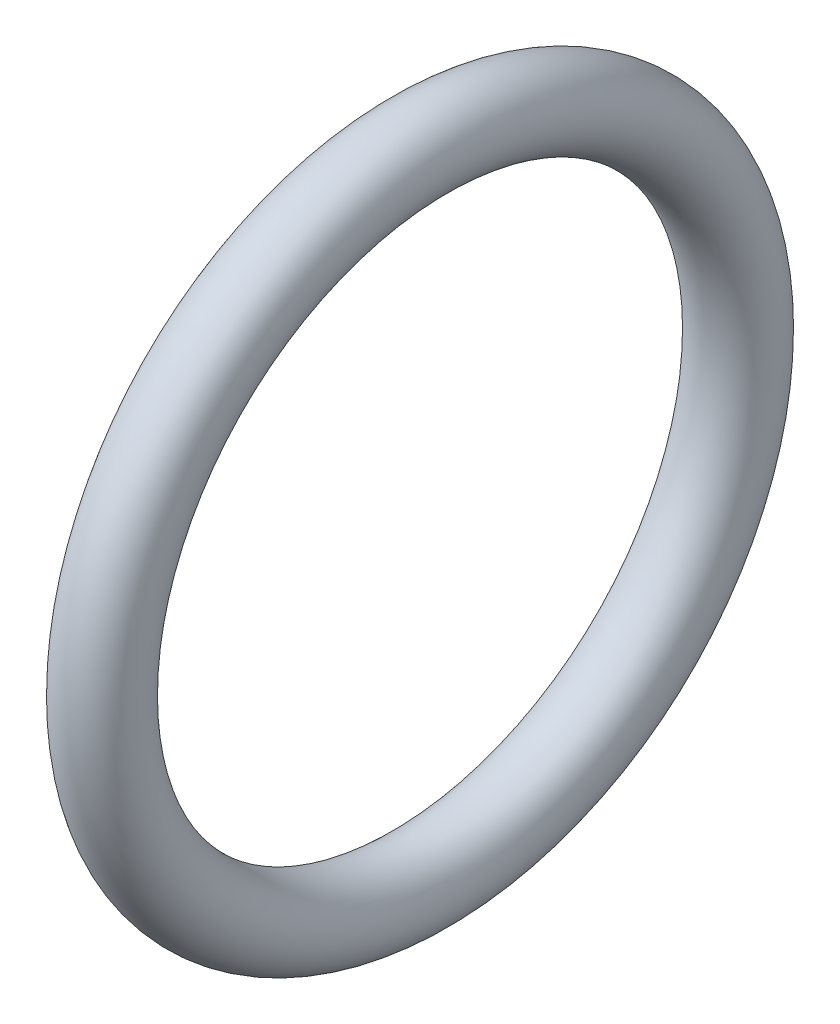
ISO-10303-21;
HEADER;
FILE_DESCRIPTION(('STEP AP214'),'2;1');
FILE_NAME('part.step','',(''),(''),'','','');
FILE_SCHEMA(('AUTOMOTIVE_DESIGN { 1 0 10303 214 1 1 1 1 }'));
ENDSEC;
DATA;
#1=APPLICATION_CONTEXT('core data for automotive mechanical design processes');
#2=APPLICATION_PROTOCOL_DEFINITION('international standard','automotive_design',2000,#1);
#3=PRODUCT_CONTEXT('',#1,'mechanical');
#4=PRODUCT('Part','Part','',(#3));
#5=PRODUCT_RELATED_PRODUCT_CATEGORY('part','',(#4));
#6=PRODUCT_DEFINITION_FORMATION('','',#4);
#7=PRODUCT_DEFINITION_CONTEXT('part definition',#1,'design');
#8=PRODUCT_DEFINITION('design','',#6,#7);
#9=PRODUCT_DEFINITION_SHAPE('','',#8);
#10=(LENGTH_UNIT() NAMED_UNIT(*) SI_UNIT(.MILLI.,.METRE.));
#11=(NAMED_UNIT(*) PLANE_ANGLE_UNIT() SI_UNIT($,.RADIAN.));
#12=(NAMED_UNIT(*) SI_UNIT($,.STERADIAN.) SOLID_ANGLE_UNIT());
#13=UNCERTAINTY_MEASURE_WITH_UNIT(LENGTH_MEASURE(1.E-05),#10,'distance_accuracy_value','');
#14=(GEOMETRIC_REPRESENTATION_CONTEXT(3) GLOBAL_UNCERTAINTY_ASSIGNED_CONTEXT((#13)) GLOBAL_UNIT_ASSIGNED_CONTEXT((#10,
#11,#12)) REPRESENTATION_CONTEXT('',''));
#15=CARTESIAN_POINT('',(0.,0.,0.));
#16=DIRECTION('',(0.,0.,1.));
#17=DIRECTION('',(1.,0.,0.));
#18=AXIS2_PLACEMENT_3D('',#15,#16,#17);
#19=CARTESIAN_POINT('',(-0.864124000000001,0.,0.));
#20=DIRECTION('',(-1.,0.,0.));
#21=DIRECTION('',(0.,0.,1.));
#22=AXIS2_PLACEMENT_3D('',#19,#20,#21);
#23=TOROIDAL_SURFACE('',#22,8.1,1.);
#24=CARTESIAN_POINT('',(-0.864124000000001,0.,9.1));
#25=VERTEX_POINT('',#24);
#26=VERTEX_LOOP('',#25);
#27=FACE_BOUND('',#26,.T.);
#28=ADVANCED_FACE('F29',(#27),#23,.T.);
#29=CLOSED_SHELL('',(#28));
#30=MANIFOLD_SOLID_BREP('B2',#29);
#31=ADVANCED_BREP_SHAPE_REPRESENTATION('',(#18,#30),#14);
#32=SHAPE_DEFINITION_REPRESENTATION(#9,#31);
ENDSEC;
END-ISO-10303-21;
